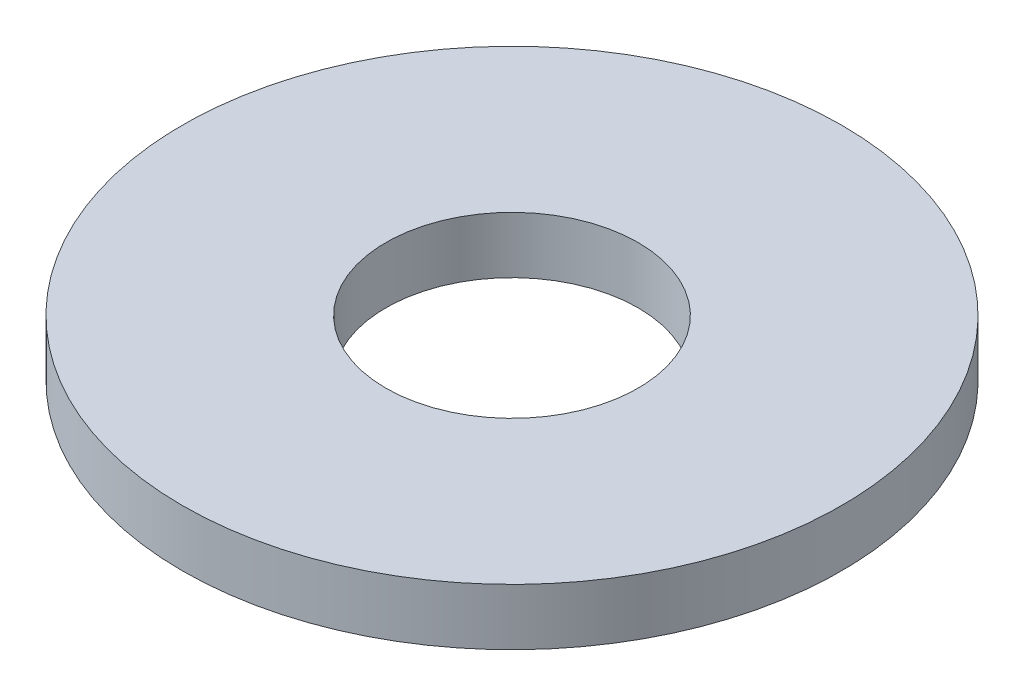
ISO-10303-21;
HEADER;
FILE_DESCRIPTION(('STEP AP214'),'2;1');
FILE_NAME('part.step','',(''),(''),'','','');
FILE_SCHEMA(('AUTOMOTIVE_DESIGN { 1 0 10303 214 1 1 1 1 }'));
ENDSEC;
DATA;
#1=APPLICATION_CONTEXT('core data for automotive mechanical design processes');
#2=APPLICATION_PROTOCOL_DEFINITION('international standard','automotive_design',2000,#1);
#3=PRODUCT_CONTEXT('',#1,'mechanical');
#4=PRODUCT('Part','Part','',(#3));
#5=PRODUCT_RELATED_PRODUCT_CATEGORY('part','',(#4));
#6=PRODUCT_DEFINITION_FORMATION('','',#4);
#7=PRODUCT_DEFINITION_CONTEXT('part definition',#1,'design');
#8=PRODUCT_DEFINITION('design','',#6,#7);
#9=PRODUCT_DEFINITION_SHAPE('','',#8);
#10=(LENGTH_UNIT() NAMED_UNIT(*) SI_UNIT(.MILLI.,.METRE.));
#11=(NAMED_UNIT(*) PLANE_ANGLE_UNIT() SI_UNIT($,.RADIAN.));
#12=(NAMED_UNIT(*) SI_UNIT($,.STERADIAN.) SOLID_ANGLE_UNIT());
#13=UNCERTAINTY_MEASURE_WITH_UNIT(LENGTH_MEASURE(1.E-05),#10,'distance_accuracy_value','');
#14=(GEOMETRIC_REPRESENTATION_CONTEXT(3) GLOBAL_UNCERTAINTY_ASSIGNED_CONTEXT((#13)) GLOBAL_UNIT_ASSIGNED_CONTEXT((#10,
#11,#12)) REPRESENTATION_CONTEXT('',''));
#15=CARTESIAN_POINT('',(0.,0.,0.));
#16=DIRECTION('',(0.,0.,1.));
#17=DIRECTION('',(1.,0.,0.));
#18=AXIS2_PLACEMENT_3D('',#15,#16,#17);
#19=CARTESIAN_POINT('',(0.,1.6002,0.));
#20=DIRECTION('',(0.,1.,0.));
#21=DIRECTION('',(0.,0.,1.));
#22=AXIS2_PLACEMENT_3D('',#19,#20,#21);
#23=PLANE('',#22);
#24=CARTESIAN_POINT('',(0.,1.6002,0.));
#25=DIRECTION('',(0.,1.,0.));
#26=DIRECTION('',(0.,0.,1.));
#27=AXIS2_PLACEMENT_3D('',#24,#25,#26);
#28=CIRCLE('',#27,9.3218);
#29=CARTESIAN_POINT('',(0.,1.6002,9.3218));
#30=VERTEX_POINT('',#29);
#31=EDGE_CURVE('E10',#30,#30,#28,.T.);
#32=ORIENTED_EDGE('',*,*,#31,.T.);
#33=EDGE_LOOP('',(#32));
#34=FACE_BOUND('',#33,.T.);
#35=CARTESIAN_POINT('',(0.,1.6002,0.));
#36=DIRECTION('',(0.,1.,0.));
#37=DIRECTION('',(0.,0.,1.));
#38=AXIS2_PLACEMENT_3D('',#35,#36,#37);
#39=CIRCLE('',#38,3.5687);
#40=CARTESIAN_POINT('',(0.,1.6002,3.5687));
#41=VERTEX_POINT('',#40);
#42=EDGE_CURVE('E44',#41,#41,#39,.T.);
#43=ORIENTED_EDGE('',*,*,#42,.F.);
#44=EDGE_LOOP('',(#43));
#45=FACE_BOUND('',#44,.T.);
#46=ADVANCED_FACE('F33',(#34,#45),#23,.T.);
#47=CARTESIAN_POINT('',(0.,0.,0.));
#48=DIRECTION('',(0.,1.,0.));
#49=DIRECTION('',(0.,0.,1.));
#50=AXIS2_PLACEMENT_3D('',#47,#48,#49);
#51=PLANE('',#50);
#52=CARTESIAN_POINT('',(0.,0.,0.));
#53=DIRECTION('',(0.,1.,0.));
#54=DIRECTION('',(0.,0.,1.));
#55=AXIS2_PLACEMENT_3D('',#52,#53,#54);
#56=CIRCLE('',#55,9.3218);
#57=CARTESIAN_POINT('',(0.,0.,9.3218));
#58=VERTEX_POINT('',#57);
#59=EDGE_CURVE('E37',#58,#58,#56,.T.);
#60=ORIENTED_EDGE('',*,*,#59,.F.);
#61=EDGE_LOOP('',(#60));
#62=FACE_BOUND('',#61,.T.);
#63=CARTESIAN_POINT('',(0.,0.,0.));
#64=DIRECTION('',(0.,1.,0.));
#65=DIRECTION('',(0.,0.,1.));
#66=AXIS2_PLACEMENT_3D('',#63,#64,#65);
#67=CIRCLE('',#66,3.5687);
#68=CARTESIAN_POINT('',(0.,0.,3.5687));
#69=VERTEX_POINT('',#68);
#70=EDGE_CURVE('E46',#69,#69,#67,.T.);
#71=ORIENTED_EDGE('',*,*,#70,.T.);
#72=EDGE_LOOP('',(#71));
#73=FACE_BOUND('',#72,.T.);
#74=ADVANCED_FACE('F56',(#62,#73),#51,.F.);
#75=CARTESIAN_POINT('',(0.,1.6002,0.));
#76=DIRECTION('',(0.,-1.,0.));
#77=DIRECTION('',(0.,0.,-1.));
#78=AXIS2_PLACEMENT_3D('',#75,#76,#77);
#79=CYLINDRICAL_SURFACE('',#78,9.3218);
#80=ORIENTED_EDGE('',*,*,#31,.F.);
#81=EDGE_LOOP('',(#80));
#82=FACE_BOUND('',#81,.T.);
#83=ORIENTED_EDGE('',*,*,#59,.T.);
#84=EDGE_LOOP('',(#83));
#85=FACE_BOUND('',#84,.T.);
#86=ADVANCED_FACE('F35',(#82,#85),#79,.T.);
#87=CARTESIAN_POINT('',(0.,1.6002,0.));
#88=DIRECTION('',(0.,-1.,0.));
#89=DIRECTION('',(0.,0.,-1.));
#90=AXIS2_PLACEMENT_3D('',#87,#88,#89);
#91=CYLINDRICAL_SURFACE('',#90,3.5687);
#92=ORIENTED_EDGE('',*,*,#42,.T.);
#93=EDGE_LOOP('',(#92));
#94=FACE_BOUND('',#93,.T.);
#95=ORIENTED_EDGE('',*,*,#70,.F.);
#96=EDGE_LOOP('',(#95));
#97=FACE_BOUND('',#96,.T.);
#98=ADVANCED_FACE('F52',(#94,#97),#91,.F.);
#99=CLOSED_SHELL('',(#46,#74,#86,#98));
#100=MANIFOLD_SOLID_BREP('B2',#99);
#101=ADVANCED_BREP_SHAPE_REPRESENTATION('',(#18,#100),#14);
#102=SHAPE_DEFINITION_REPRESENTATION(#9,#101);
ENDSEC;
END-ISO-10303-21;
